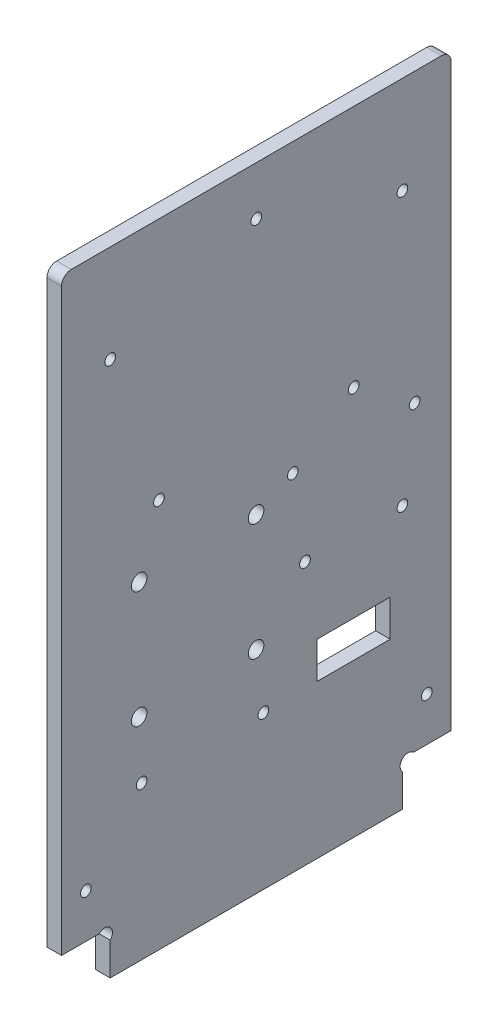
ISO-10303-21;
HEADER;
FILE_DESCRIPTION(('STEP AP214'),'2;1');
FILE_NAME('part.step','',(''),(''),'','','');
FILE_SCHEMA(('AUTOMOTIVE_DESIGN { 1 0 10303 214 1 1 1 1 }'));
ENDSEC;
DATA;
#1=APPLICATION_CONTEXT('core data for automotive mechanical design processes');
#2=APPLICATION_PROTOCOL_DEFINITION('international standard','automotive_design',2000,#1);
#3=PRODUCT_CONTEXT('',#1,'mechanical');
#4=PRODUCT('Part','Part','',(#3));
#5=PRODUCT_RELATED_PRODUCT_CATEGORY('part','',(#4));
#6=PRODUCT_DEFINITION_FORMATION('','',#4);
#7=PRODUCT_DEFINITION_CONTEXT('part definition',#1,'design');
#8=PRODUCT_DEFINITION('design','',#6,#7);
#9=PRODUCT_DEFINITION_SHAPE('','',#8);
#10=(LENGTH_UNIT() NAMED_UNIT(*) SI_UNIT(.MILLI.,.METRE.));
#11=(NAMED_UNIT(*) PLANE_ANGLE_UNIT() SI_UNIT($,.RADIAN.));
#12=(NAMED_UNIT(*) SI_UNIT($,.STERADIAN.) SOLID_ANGLE_UNIT());
#13=UNCERTAINTY_MEASURE_WITH_UNIT(LENGTH_MEASURE(1.E-05),#10,'distance_accuracy_value','');
#14=(GEOMETRIC_REPRESENTATION_CONTEXT(3) GLOBAL_UNCERTAINTY_ASSIGNED_CONTEXT((#13)) GLOBAL_UNIT_ASSIGNED_CONTEXT((#10,
#11,#12)) REPRESENTATION_CONTEXT('',''));
#15=CARTESIAN_POINT('',(0.,0.,0.));
#16=DIRECTION('',(0.,0.,1.));
#17=DIRECTION('',(1.,0.,0.));
#18=AXIS2_PLACEMENT_3D('',#15,#16,#17);
#19=CARTESIAN_POINT('',(3.,7.86862915010153,-8.86862915010152));
#20=DIRECTION('',(-1.,0.,0.));
#21=DIRECTION('',(0.,0.,1.));
#22=AXIS2_PLACEMENT_3D('',#19,#20,#21);
#23=CYLINDRICAL_SURFACE('',#22,1.6);
#24=CARTESIAN_POINT('',(0.,7.86862915010153,-8.86862915010152));
#25=DIRECTION('',(-1.,0.,0.));
#26=DIRECTION('',(0.,0.,-1.));
#27=AXIS2_PLACEMENT_3D('',#24,#25,#26);
#28=CIRCLE('',#27,1.6);
#29=CARTESIAN_POINT('',(0.,9.,-7.73725830020304));
#30=VERTEX_POINT('',#29);
#31=CARTESIAN_POINT('',(0.,6.73725830020305,-10.));
#32=VERTEX_POINT('',#31);
#33=EDGE_CURVE('E260',#30,#32,#28,.T.);
#34=ORIENTED_EDGE('',*,*,#33,.T.);
#35=DIRECTION('',(-1.,0.,0.));
#36=VECTOR('',#35,1.);
#37=CARTESIAN_POINT('',(3.,6.73725830020305,-10.));
#38=LINE('',#37,#36);
#39=CARTESIAN_POINT('',(3.,6.73725830020305,-10.));
#40=VERTEX_POINT('',#39);
#41=EDGE_CURVE('E326',#40,#32,#38,.T.);
#42=ORIENTED_EDGE('',*,*,#41,.F.);
#43=CARTESIAN_POINT('',(3.,7.86862915010153,-8.86862915010152));
#44=DIRECTION('',(-1.,0.,0.));
#45=DIRECTION('',(0.,0.,-1.));
#46=AXIS2_PLACEMENT_3D('',#43,#44,#45);
#47=CIRCLE('',#46,1.6);
#48=CARTESIAN_POINT('',(3.,9.,-7.73725830020304));
#49=VERTEX_POINT('',#48);
#50=EDGE_CURVE('E263',#49,#40,#47,.T.);
#51=ORIENTED_EDGE('',*,*,#50,.F.);
#52=DIRECTION('',(-1.,0.,0.));
#53=VECTOR('',#52,1.);
#54=CARTESIAN_POINT('',(3.,9.,-7.73725830020304));
#55=LINE('',#54,#53);
#56=EDGE_CURVE('E285',#49,#30,#55,.T.);
#57=ORIENTED_EDGE('',*,*,#56,.T.);
#58=EDGE_LOOP('',(#34,#42,#51,#57));
#59=FACE_BOUND('',#58,.T.);
#60=ADVANCED_FACE('F33',(#59),#23,.F.);
#61=CARTESIAN_POINT('',(3.,6.73725830020305,-10.));
#62=DIRECTION('',(0.,0.,-1.));
#63=DIRECTION('',(-1.,0.,0.));
#64=AXIS2_PLACEMENT_3D('',#61,#62,#63);
#65=PLANE('',#64);
#66=DIRECTION('',(0.,-1.,0.));
#67=VECTOR('',#66,1.);
#68=CARTESIAN_POINT('',(0.,6.73725830020305,-10.));
#69=LINE('',#68,#67);
#70=CARTESIAN_POINT('',(0.,0.,-10.));
#71=VERTEX_POINT('',#70);
#72=EDGE_CURVE('E288',#32,#71,#69,.T.);
#73=ORIENTED_EDGE('',*,*,#72,.T.);
#74=DIRECTION('',(-1.,0.,0.));
#75=VECTOR('',#74,1.);
#76=CARTESIAN_POINT('',(3.,0.,-10.));
#77=LINE('',#76,#75);
#78=CARTESIAN_POINT('',(3.,0.,-10.));
#79=VERTEX_POINT('',#78);
#80=EDGE_CURVE('E323',#79,#71,#77,.T.);
#81=ORIENTED_EDGE('',*,*,#80,.F.);
#82=DIRECTION('',(0.,-1.,0.));
#83=VECTOR('',#82,1.);
#84=CARTESIAN_POINT('',(3.,6.73725830020305,-10.));
#85=LINE('',#84,#83);
#86=EDGE_CURVE('E266',#40,#79,#85,.T.);
#87=ORIENTED_EDGE('',*,*,#86,.F.);
#88=ORIENTED_EDGE('',*,*,#41,.T.);
#89=EDGE_LOOP('',(#73,#81,#87,#88));
#90=FACE_BOUND('',#89,.T.);
#91=ADVANCED_FACE('F377',(#90),#65,.F.);
#92=CARTESIAN_POINT('',(3.,0.,-10.));
#93=DIRECTION('',(0.,1.,0.));
#94=DIRECTION('',(0.,0.,1.));
#95=AXIS2_PLACEMENT_3D('',#92,#93,#94);
#96=PLANE('',#95);
#97=DIRECTION('',(0.,0.,-1.));
#98=VECTOR('',#97,1.);
#99=CARTESIAN_POINT('',(0.,0.,-10.));
#100=LINE('',#99,#98);
#101=CARTESIAN_POINT('',(0.,0.,-70.));
#102=VERTEX_POINT('',#101);
#103=EDGE_CURVE('E290',#71,#102,#100,.T.);
#104=ORIENTED_EDGE('',*,*,#103,.T.);
#105=DIRECTION('',(-1.,0.,0.));
#106=VECTOR('',#105,1.);
#107=CARTESIAN_POINT('',(3.,0.,-70.));
#108=LINE('',#107,#106);
#109=CARTESIAN_POINT('',(3.,0.,-70.));
#110=VERTEX_POINT('',#109);
#111=EDGE_CURVE('E320',#110,#102,#108,.T.);
#112=ORIENTED_EDGE('',*,*,#111,.F.);
#113=DIRECTION('',(0.,0.,-1.));
#114=VECTOR('',#113,1.);
#115=CARTESIAN_POINT('',(3.,0.,-10.));
#116=LINE('',#115,#114);
#117=EDGE_CURVE('E269',#79,#110,#116,.T.);
#118=ORIENTED_EDGE('',*,*,#117,.F.);
#119=ORIENTED_EDGE('',*,*,#80,.T.);
#120=EDGE_LOOP('',(#104,#112,#118,#119));
#121=FACE_BOUND('',#120,.T.);
#122=ADVANCED_FACE('F371',(#121),#96,.F.);
#123=CARTESIAN_POINT('',(3.,6.73725830020307,-70.));
#124=DIRECTION('',(0.,0.,1.));
#125=DIRECTION('',(0.,-1.,0.));
#126=AXIS2_PLACEMENT_3D('',#123,#124,#125);
#127=PLANE('',#126);
#128=DIRECTION('',(0.,1.,0.));
#129=VECTOR('',#128,1.);
#130=CARTESIAN_POINT('',(0.,6.73725830020307,-70.));
#131=LINE('',#130,#129);
#132=CARTESIAN_POINT('',(0.,6.73725830020307,-70.));
#133=VERTEX_POINT('',#132);
#134=EDGE_CURVE('E292',#102,#133,#131,.T.);
#135=ORIENTED_EDGE('',*,*,#134,.T.);
#136=DIRECTION('',(-1.,0.,0.));
#137=VECTOR('',#136,1.);
#138=CARTESIAN_POINT('',(3.,6.73725830020307,-70.));
#139=LINE('',#138,#137);
#140=CARTESIAN_POINT('',(3.,6.73725830020307,-70.));
#141=VERTEX_POINT('',#140);
#142=EDGE_CURVE('E317',#141,#133,#139,.T.);
#143=ORIENTED_EDGE('',*,*,#142,.F.);
#144=DIRECTION('',(0.,1.,0.));
#145=VECTOR('',#144,1.);
#146=CARTESIAN_POINT('',(3.,6.73725830020307,-70.));
#147=LINE('',#146,#145);
#148=EDGE_CURVE('E271',#110,#141,#147,.T.);
#149=ORIENTED_EDGE('',*,*,#148,.F.);
#150=ORIENTED_EDGE('',*,*,#111,.T.);
#151=EDGE_LOOP('',(#135,#143,#149,#150));
#152=FACE_BOUND('',#151,.T.);
#153=ADVANCED_FACE('F367',(#152),#127,.F.);
#154=CARTESIAN_POINT('',(3.,7.86862915010154,-71.1313708498985));
#155=DIRECTION('',(-1.,0.,0.));
#156=DIRECTION('',(0.,0.,1.));
#157=AXIS2_PLACEMENT_3D('',#154,#155,#156);
#158=CYLINDRICAL_SURFACE('',#157,1.6);
#159=CARTESIAN_POINT('',(0.,7.86862915010154,-71.1313708498985));
#160=DIRECTION('',(-1.,0.,0.));
#161=DIRECTION('',(0.,0.,1.));
#162=AXIS2_PLACEMENT_3D('',#159,#160,#161);
#163=CIRCLE('',#162,1.6);
#164=CARTESIAN_POINT('',(0.,8.99999999999999,-72.262741699797));
#165=VERTEX_POINT('',#164);
#166=EDGE_CURVE('E294',#133,#165,#163,.T.);
#167=ORIENTED_EDGE('',*,*,#166,.T.);
#168=DIRECTION('',(-1.,0.,0.));
#169=VECTOR('',#168,1.);
#170=CARTESIAN_POINT('',(3.,8.99999999999999,-72.262741699797));
#171=LINE('',#170,#169);
#172=CARTESIAN_POINT('',(3.,8.99999999999999,-72.262741699797));
#173=VERTEX_POINT('',#172);
#174=EDGE_CURVE('E314',#173,#165,#171,.T.);
#175=ORIENTED_EDGE('',*,*,#174,.F.);
#176=CARTESIAN_POINT('',(3.,7.86862915010154,-71.1313708498985));
#177=DIRECTION('',(-1.,0.,0.));
#178=DIRECTION('',(0.,0.,1.));
#179=AXIS2_PLACEMENT_3D('',#176,#177,#178);
#180=CIRCLE('',#179,1.6);
#181=EDGE_CURVE('E273',#141,#173,#180,.T.);
#182=ORIENTED_EDGE('',*,*,#181,.F.);
#183=ORIENTED_EDGE('',*,*,#142,.T.);
#184=EDGE_LOOP('',(#167,#175,#182,#183));
#185=FACE_BOUND('',#184,.T.);
#186=ADVANCED_FACE('F362',(#185),#158,.F.);
#187=CARTESIAN_POINT('',(3.,8.99999999999999,-72.262741699797));
#188=DIRECTION('',(0.,1.,0.));
#189=DIRECTION('',(0.,0.,1.));
#190=AXIS2_PLACEMENT_3D('',#187,#188,#189);
#191=PLANE('',#190);
#192=DIRECTION('',(0.,0.,-1.));
#193=VECTOR('',#192,1.);
#194=CARTESIAN_POINT('',(0.,8.99999999999999,-72.262741699797));
#195=LINE('',#194,#193);
#196=CARTESIAN_POINT('',(0.,8.99999999999999,-80.));
#197=VERTEX_POINT('',#196);
#198=EDGE_CURVE('E296',#165,#197,#195,.T.);
#199=ORIENTED_EDGE('',*,*,#198,.T.);
#200=DIRECTION('',(-1.,0.,0.));
#201=VECTOR('',#200,1.);
#202=CARTESIAN_POINT('',(3.,8.99999999999999,-80.));
#203=LINE('',#202,#201);
#204=CARTESIAN_POINT('',(3.,8.99999999999999,-80.));
#205=VERTEX_POINT('',#204);
#206=EDGE_CURVE('E311',#205,#197,#203,.T.);
#207=ORIENTED_EDGE('',*,*,#206,.F.);
#208=DIRECTION('',(0.,0.,-1.));
#209=VECTOR('',#208,1.);
#210=CARTESIAN_POINT('',(3.,8.99999999999999,-72.262741699797));
#211=LINE('',#210,#209);
#212=EDGE_CURVE('E275',#173,#205,#211,.T.);
#213=ORIENTED_EDGE('',*,*,#212,.F.);
#214=ORIENTED_EDGE('',*,*,#174,.T.);
#215=EDGE_LOOP('',(#199,#207,#213,#214));
#216=FACE_BOUND('',#215,.T.);
#217=ADVANCED_FACE('F356',(#216),#191,.F.);
#218=CARTESIAN_POINT('',(3.,130.,-80.));
#219=DIRECTION('',(0.,0.,1.));
#220=DIRECTION('',(0.,-1.,0.));
#221=AXIS2_PLACEMENT_3D('',#218,#219,#220);
#222=PLANE('',#221);
#223=DIRECTION('',(0.,1.,0.));
#224=VECTOR('',#223,1.);
#225=CARTESIAN_POINT('',(0.,130.,-80.));
#226=LINE('',#225,#224);
#227=CARTESIAN_POINT('',(0.,128.,-80.));
#228=VERTEX_POINT('',#227);
#229=EDGE_CURVE('E298',#197,#228,#226,.T.);
#230=ORIENTED_EDGE('',*,*,#229,.T.);
#231=DIRECTION('',(-1.,0.,0.));
#232=VECTOR('',#231,1.);
#233=CARTESIAN_POINT('',(3.,128.,-80.));
#234=LINE('',#233,#232);
#235=CARTESIAN_POINT('',(3.,128.,-80.));
#236=VERTEX_POINT('',#235);
#237=EDGE_CURVE('E56',#228,#236,#234,.F.);
#238=ORIENTED_EDGE('',*,*,#237,.T.);
#239=DIRECTION('',(0.,1.,0.));
#240=VECTOR('',#239,1.);
#241=CARTESIAN_POINT('',(3.,130.,-80.));
#242=LINE('',#241,#240);
#243=EDGE_CURVE('E277',#205,#236,#242,.T.);
#244=ORIENTED_EDGE('',*,*,#243,.F.);
#245=ORIENTED_EDGE('',*,*,#206,.T.);
#246=EDGE_LOOP('',(#230,#238,#244,#245));
#247=FACE_BOUND('',#246,.T.);
#248=ADVANCED_FACE('F352',(#247),#222,.F.);
#249=CARTESIAN_POINT('',(3.,130.,0.));
#250=DIRECTION('',(0.,-1.,0.));
#251=DIRECTION('',(0.,0.,-1.));
#252=AXIS2_PLACEMENT_3D('',#249,#250,#251);
#253=PLANE('',#252);
#254=DIRECTION('',(0.,0.,1.));
#255=VECTOR('',#254,1.);
#256=CARTESIAN_POINT('',(3.,130.,0.));
#257=LINE('',#256,#255);
#258=CARTESIAN_POINT('',(3.,130.,-78.));
#259=VERTEX_POINT('',#258);
#260=CARTESIAN_POINT('',(3.,130.,-2.));
#261=VERTEX_POINT('',#260);
#262=EDGE_CURVE('E279',#259,#261,#257,.T.);
#263=ORIENTED_EDGE('',*,*,#262,.F.);
#264=DIRECTION('',(-1.,0.,0.));
#265=VECTOR('',#264,1.);
#266=CARTESIAN_POINT('',(3.,130.,-78.));
#267=LINE('',#266,#265);
#268=CARTESIAN_POINT('',(0.,130.,-78.));
#269=VERTEX_POINT('',#268);
#270=EDGE_CURVE('E331',#259,#269,#267,.T.);
#271=ORIENTED_EDGE('',*,*,#270,.T.);
#272=DIRECTION('',(0.,0.,1.));
#273=VECTOR('',#272,1.);
#274=CARTESIAN_POINT('',(0.,130.,0.));
#275=LINE('',#274,#273);
#276=CARTESIAN_POINT('',(0.,130.,-2.));
#277=VERTEX_POINT('',#276);
#278=EDGE_CURVE('E300',#269,#277,#275,.T.);
#279=ORIENTED_EDGE('',*,*,#278,.T.);
#280=DIRECTION('',(-1.,0.,0.));
#281=VECTOR('',#280,1.);
#282=CARTESIAN_POINT('',(3.,130.,-2.));
#283=LINE('',#282,#281);
#284=EDGE_CURVE('E329',#277,#261,#283,.F.);
#285=ORIENTED_EDGE('',*,*,#284,.T.);
#286=EDGE_LOOP('',(#263,#271,#279,#285));
#287=FACE_BOUND('',#286,.T.);
#288=ADVANCED_FACE('F344',(#287),#253,.F.);
#289=CARTESIAN_POINT('',(3.,9.,0.));
#290=DIRECTION('',(0.,0.,-1.));
#291=DIRECTION('',(-1.,0.,0.));
#292=AXIS2_PLACEMENT_3D('',#289,#290,#291);
#293=PLANE('',#292);
#294=DIRECTION('',(0.,-1.,0.));
#295=VECTOR('',#294,1.);
#296=CARTESIAN_POINT('',(3.,9.,0.));
#297=LINE('',#296,#295);
#298=CARTESIAN_POINT('',(3.,128.,0.));
#299=VERTEX_POINT('',#298);
#300=CARTESIAN_POINT('',(3.,9.,0.));
#301=VERTEX_POINT('',#300);
#302=EDGE_CURVE('E281',#299,#301,#297,.T.);
#303=ORIENTED_EDGE('',*,*,#302,.F.);
#304=DIRECTION('',(-1.,0.,0.));
#305=VECTOR('',#304,1.);
#306=CARTESIAN_POINT('',(3.,128.,0.));
#307=LINE('',#306,#305);
#308=CARTESIAN_POINT('',(0.,128.,0.));
#309=VERTEX_POINT('',#308);
#310=EDGE_CURVE('E11',#299,#309,#307,.T.);
#311=ORIENTED_EDGE('',*,*,#310,.T.);
#312=DIRECTION('',(0.,-1.,0.));
#313=VECTOR('',#312,1.);
#314=CARTESIAN_POINT('',(0.,9.,0.));
#315=LINE('',#314,#313);
#316=CARTESIAN_POINT('',(0.,9.,0.));
#317=VERTEX_POINT('',#316);
#318=EDGE_CURVE('E303',#309,#317,#315,.T.);
#319=ORIENTED_EDGE('',*,*,#318,.T.);
#320=DIRECTION('',(-1.,0.,0.));
#321=VECTOR('',#320,1.);
#322=CARTESIAN_POINT('',(3.,9.,0.));
#323=LINE('',#322,#321);
#324=EDGE_CURVE('E308',#301,#317,#323,.T.);
#325=ORIENTED_EDGE('',*,*,#324,.F.);
#326=EDGE_LOOP('',(#303,#311,#319,#325));
#327=FACE_BOUND('',#326,.T.);
#328=ADVANCED_FACE('F387',(#327),#293,.F.);
#329=CARTESIAN_POINT('',(3.,9.,-7.73725830020304));
#330=DIRECTION('',(0.,1.,0.));
#331=DIRECTION('',(0.,0.,1.));
#332=AXIS2_PLACEMENT_3D('',#329,#330,#331);
#333=PLANE('',#332);
#334=DIRECTION('',(0.,0.,-1.));
#335=VECTOR('',#334,1.);
#336=CARTESIAN_POINT('',(0.,9.,-7.73725830020304));
#337=LINE('',#336,#335);
#338=EDGE_CURVE('E267',#317,#30,#337,.T.);
#339=ORIENTED_EDGE('',*,*,#338,.T.);
#340=ORIENTED_EDGE('',*,*,#56,.F.);
#341=DIRECTION('',(0.,0.,-1.));
#342=VECTOR('',#341,1.);
#343=CARTESIAN_POINT('',(3.,9.,-7.73725830020304));
#344=LINE('',#343,#342);
#345=EDGE_CURVE('E283',#301,#49,#344,.T.);
#346=ORIENTED_EDGE('',*,*,#345,.F.);
#347=ORIENTED_EDGE('',*,*,#324,.T.);
#348=EDGE_LOOP('',(#339,#340,#346,#347));
#349=FACE_BOUND('',#348,.T.);
#350=ADVANCED_FACE('F383',(#349),#333,.F.);
#351=CARTESIAN_POINT('',(3.,7.86862915010153,-8.86862915010152));
#352=DIRECTION('',(1.,0.,0.));
#353=DIRECTION('',(0.,0.,-1.));
#354=AXIS2_PLACEMENT_3D('',#351,#352,#353);
#355=PLANE('',#354);
#356=CARTESIAN_POINT('',(3.,31.45,-16.45));
#357=DIRECTION('',(1.,0.,0.));
#358=DIRECTION('',(0.,0.,-1.));
#359=AXIS2_PLACEMENT_3D('',#356,#357,#358);
#360=CIRCLE('',#359,1.1);
#361=CARTESIAN_POINT('',(3.,31.45,-17.55));
#362=VERTEX_POINT('',#361);
#363=EDGE_CURVE('E510',#362,#362,#360,.T.);
#364=ORIENTED_EDGE('',*,*,#363,.F.);
#365=EDGE_LOOP('',(#364));
#366=FACE_BOUND('',#365,.T.);
#367=CARTESIAN_POINT('',(3.,31.45,-41.45));
#368=DIRECTION('',(1.,0.,0.));
#369=DIRECTION('',(0.,0.,-1.));
#370=AXIS2_PLACEMENT_3D('',#367,#368,#369);
#371=CIRCLE('',#370,1.1);
#372=CARTESIAN_POINT('',(3.,31.45,-42.55));
#373=VERTEX_POINT('',#372);
#374=EDGE_CURVE('E515',#373,#373,#371,.T.);
#375=ORIENTED_EDGE('',*,*,#374,.F.);
#376=EDGE_LOOP('',(#375));
#377=FACE_BOUND('',#376,.T.);
#378=CARTESIAN_POINT('',(3.,71.,-47.5));
#379=DIRECTION('',(1.,0.,0.));
#380=DIRECTION('',(0.,0.,-1.));
#381=AXIS2_PLACEMENT_3D('',#378,#379,#380);
#382=CIRCLE('',#381,1.1);
#383=CARTESIAN_POINT('',(3.,71.,-48.6));
#384=VERTEX_POINT('',#383);
#385=EDGE_CURVE('E523',#384,#384,#382,.T.);
#386=ORIENTED_EDGE('',*,*,#385,.F.);
#387=EDGE_LOOP('',(#386));
#388=FACE_BOUND('',#387,.T.);
#389=CARTESIAN_POINT('',(3.,71.,-72.5));
#390=DIRECTION('',(1.,0.,0.));
#391=DIRECTION('',(0.,0.,-1.));
#392=AXIS2_PLACEMENT_3D('',#389,#390,#391);
#393=CIRCLE('',#392,1.10000000000001);
#394=CARTESIAN_POINT('',(3.,71.,-73.6));
#395=VERTEX_POINT('',#394);
#396=EDGE_CURVE('E529',#395,#395,#393,.T.);
#397=ORIENTED_EDGE('',*,*,#396,.F.);
#398=EDGE_LOOP('',(#397));
#399=FACE_BOUND('',#398,.T.);
#400=CARTESIAN_POINT('',(3.,18.,-75.));
#401=DIRECTION('',(1.,0.,0.));
#402=DIRECTION('',(0.,0.,-1.));
#403=AXIS2_PLACEMENT_3D('',#400,#401,#402);
#404=CIRCLE('',#403,1.10000000000001);
#405=CARTESIAN_POINT('',(3.,18.,-76.1));
#406=VERTEX_POINT('',#405);
#407=EDGE_CURVE('E534',#406,#406,#404,.T.);
#408=ORIENTED_EDGE('',*,*,#407,.F.);
#409=EDGE_LOOP('',(#408));
#410=FACE_BOUND('',#409,.T.);
#411=CARTESIAN_POINT('',(3.,18.,-5.));
#412=DIRECTION('',(1.,0.,0.));
#413=DIRECTION('',(0.,0.,-1.));
#414=AXIS2_PLACEMENT_3D('',#411,#412,#413);
#415=CIRCLE('',#414,1.1);
#416=CARTESIAN_POINT('',(3.,18.,-6.1));
#417=VERTEX_POINT('',#416);
#418=EDGE_CURVE('E180',#417,#417,#415,.T.);
#419=ORIENTED_EDGE('',*,*,#418,.F.);
#420=EDGE_LOOP('',(#419));
#421=FACE_BOUND('',#420,.T.);
#422=DIRECTION('',(0.,-1.,0.));
#423=VECTOR('',#422,1.);
#424=CARTESIAN_POINT('',(3.,39.,-67.5));
#425=LINE('',#424,#423);
#426=CARTESIAN_POINT('',(3.,39.,-67.5));
#427=VERTEX_POINT('',#426);
#428=CARTESIAN_POINT('',(3.,31.5,-67.5));
#429=VERTEX_POINT('',#428);
#430=EDGE_CURVE('E153',#427,#429,#425,.T.);
#431=ORIENTED_EDGE('',*,*,#430,.T.);
#432=DIRECTION('',(0.,0.,1.));
#433=VECTOR('',#432,1.);
#434=CARTESIAN_POINT('',(3.,31.5,-67.5));
#435=LINE('',#434,#433);
#436=CARTESIAN_POINT('',(3.,31.5,-52.5));
#437=VERTEX_POINT('',#436);
#438=EDGE_CURVE('E165',#429,#437,#435,.T.);
#439=ORIENTED_EDGE('',*,*,#438,.T.);
#440=DIRECTION('',(0.,1.,0.));
#441=VECTOR('',#440,1.);
#442=CARTESIAN_POINT('',(3.,39.,-52.5));
#443=LINE('',#442,#441);
#444=CARTESIAN_POINT('',(3.,39.,-52.5));
#445=VERTEX_POINT('',#444);
#446=EDGE_CURVE('E169',#437,#445,#443,.T.);
#447=ORIENTED_EDGE('',*,*,#446,.T.);
#448=DIRECTION('',(0.,0.,-1.));
#449=VECTOR('',#448,1.);
#450=CARTESIAN_POINT('',(3.,39.,-67.5));
#451=LINE('',#450,#449);
#452=EDGE_CURVE('E161',#445,#427,#451,.T.);
#453=ORIENTED_EDGE('',*,*,#452,.T.);
#454=EDGE_LOOP('',(#431,#439,#447,#453));
#455=FACE_BOUND('',#454,.T.);
#456=CARTESIAN_POINT('',(3.,67.45,-39.95));
#457=DIRECTION('',(1.,0.,0.));
#458=DIRECTION('',(0.,0.,-1.));
#459=AXIS2_PLACEMENT_3D('',#456,#457,#458);
#460=CIRCLE('',#459,1.6);
#461=CARTESIAN_POINT('',(3.,67.45,-41.55));
#462=VERTEX_POINT('',#461);
#463=EDGE_CURVE('E193',#462,#462,#460,.T.);
#464=ORIENTED_EDGE('',*,*,#463,.F.);
#465=EDGE_LOOP('',(#464));
#466=FACE_BOUND('',#465,.T.);
#467=CARTESIAN_POINT('',(3.,43.45,-39.95));
#468=DIRECTION('',(1.,0.,0.));
#469=DIRECTION('',(0.,0.,-1.));
#470=AXIS2_PLACEMENT_3D('',#467,#468,#469);
#471=CIRCLE('',#470,1.6);
#472=CARTESIAN_POINT('',(3.,43.45,-41.55));
#473=VERTEX_POINT('',#472);
#474=EDGE_CURVE('E200',#473,#473,#471,.T.);
#475=ORIENTED_EDGE('',*,*,#474,.F.);
#476=EDGE_LOOP('',(#475));
#477=FACE_BOUND('',#476,.T.);
#478=CARTESIAN_POINT('',(3.,43.45,-15.95));
#479=DIRECTION('',(1.,0.,0.));
#480=DIRECTION('',(0.,0.,-1.));
#481=AXIS2_PLACEMENT_3D('',#478,#479,#480);
#482=CIRCLE('',#481,1.6);
#483=CARTESIAN_POINT('',(3.,43.45,-17.55));
#484=VERTEX_POINT('',#483);
#485=EDGE_CURVE('E206',#484,#484,#482,.T.);
#486=ORIENTED_EDGE('',*,*,#485,.F.);
#487=EDGE_LOOP('',(#486));
#488=FACE_BOUND('',#487,.T.);
#489=CARTESIAN_POINT('',(3.,67.45,-15.95));
#490=DIRECTION('',(1.,0.,0.));
#491=DIRECTION('',(0.,0.,-1.));
#492=AXIS2_PLACEMENT_3D('',#489,#490,#491);
#493=CIRCLE('',#492,1.6);
#494=CARTESIAN_POINT('',(3.,67.45,-17.55));
#495=VERTEX_POINT('',#494);
#496=EDGE_CURVE('E212',#495,#495,#493,.T.);
#497=ORIENTED_EDGE('',*,*,#496,.F.);
#498=EDGE_LOOP('',(#497));
#499=FACE_BOUND('',#498,.T.);
#500=CARTESIAN_POINT('',(3.,120.,-40.));
#501=DIRECTION('',(1.,0.,0.));
#502=DIRECTION('',(0.,0.,-1.));
#503=AXIS2_PLACEMENT_3D('',#500,#501,#502);
#504=CIRCLE('',#503,1.1);
#505=CARTESIAN_POINT('',(3.,120.,-41.1));
#506=VERTEX_POINT('',#505);
#507=EDGE_CURVE('E218',#506,#506,#504,.T.);
#508=ORIENTED_EDGE('',*,*,#507,.F.);
#509=EDGE_LOOP('',(#508));
#510=FACE_BOUND('',#509,.T.);
#511=CARTESIAN_POINT('',(3.,80.,-20.));
#512=DIRECTION('',(1.,0.,0.));
#513=DIRECTION('',(0.,0.,1.));
#514=AXIS2_PLACEMENT_3D('',#511,#512,#513);
#515=CIRCLE('',#514,1.1);
#516=CARTESIAN_POINT('',(3.,80.,-18.9));
#517=VERTEX_POINT('',#516);
#518=EDGE_CURVE('E224',#517,#517,#515,.T.);
#519=ORIENTED_EDGE('',*,*,#518,.F.);
#520=EDGE_LOOP('',(#519));
#521=FACE_BOUND('',#520,.T.);
#522=CARTESIAN_POINT('',(3.,54.,-70.));
#523=DIRECTION('',(1.,0.,0.));
#524=DIRECTION('',(0.,0.,-1.));
#525=AXIS2_PLACEMENT_3D('',#522,#523,#524);
#526=CIRCLE('',#525,1.10000000000001);
#527=CARTESIAN_POINT('',(3.,54.,-71.1));
#528=VERTEX_POINT('',#527);
#529=EDGE_CURVE('E230',#528,#528,#526,.T.);
#530=ORIENTED_EDGE('',*,*,#529,.F.);
#531=EDGE_LOOP('',(#530));
#532=FACE_BOUND('',#531,.T.);
#533=CARTESIAN_POINT('',(3.,54.,-50.));
#534=DIRECTION('',(1.,0.,0.));
#535=DIRECTION('',(0.,0.,-1.));
#536=AXIS2_PLACEMENT_3D('',#533,#534,#535);
#537=CIRCLE('',#536,1.1);
#538=CARTESIAN_POINT('',(3.,54.,-51.1));
#539=VERTEX_POINT('',#538);
#540=EDGE_CURVE('E236',#539,#539,#537,.T.);
#541=ORIENTED_EDGE('',*,*,#540,.F.);
#542=EDGE_LOOP('',(#541));
#543=FACE_BOUND('',#542,.T.);
#544=CARTESIAN_POINT('',(3.,110.,-70.));
#545=DIRECTION('',(1.,0.,0.));
#546=DIRECTION('',(0.,0.,-1.));
#547=AXIS2_PLACEMENT_3D('',#544,#545,#546);
#548=CIRCLE('',#547,1.10000000000001);
#549=CARTESIAN_POINT('',(3.,110.,-71.1));
#550=VERTEX_POINT('',#549);
#551=EDGE_CURVE('E242',#550,#550,#548,.T.);
#552=ORIENTED_EDGE('',*,*,#551,.F.);
#553=EDGE_LOOP('',(#552));
#554=FACE_BOUND('',#553,.T.);
#555=CARTESIAN_POINT('',(3.,80.,-60.));
#556=DIRECTION('',(1.,0.,0.));
#557=DIRECTION('',(0.,0.,-1.));
#558=AXIS2_PLACEMENT_3D('',#555,#556,#557);
#559=CIRCLE('',#558,1.1);
#560=CARTESIAN_POINT('',(3.,80.,-61.1));
#561=VERTEX_POINT('',#560);
#562=EDGE_CURVE('E248',#561,#561,#559,.T.);
#563=ORIENTED_EDGE('',*,*,#562,.F.);
#564=EDGE_LOOP('',(#563));
#565=FACE_BOUND('',#564,.T.);
#566=CARTESIAN_POINT('',(3.,110.,-10.));
#567=DIRECTION('',(1.,0.,0.));
#568=DIRECTION('',(0.,0.,-1.));
#569=AXIS2_PLACEMENT_3D('',#566,#567,#568);
#570=CIRCLE('',#569,1.1);
#571=CARTESIAN_POINT('',(3.,110.,-11.1));
#572=VERTEX_POINT('',#571);
#573=EDGE_CURVE('E254',#572,#572,#570,.T.);
#574=ORIENTED_EDGE('',*,*,#573,.F.);
#575=EDGE_LOOP('',(#574));
#576=FACE_BOUND('',#575,.T.);
#577=ORIENTED_EDGE('',*,*,#243,.T.);
#578=CARTESIAN_POINT('',(3.,128.,-78.));
#579=DIRECTION('',(1.,0.,0.));
#580=DIRECTION('',(0.,0.,-1.));
#581=AXIS2_PLACEMENT_3D('',#578,#579,#580);
#582=CIRCLE('',#581,2.);
#583=EDGE_CURVE('E41',#236,#259,#582,.T.);
#584=ORIENTED_EDGE('',*,*,#583,.T.);
#585=ORIENTED_EDGE('',*,*,#262,.T.);
#586=CARTESIAN_POINT('',(3.,128.,-2.));
#587=DIRECTION('',(1.,0.,0.));
#588=DIRECTION('',(0.,0.,-1.));
#589=AXIS2_PLACEMENT_3D('',#586,#587,#588);
#590=CIRCLE('',#589,2.);
#591=EDGE_CURVE('E48',#261,#299,#590,.T.);
#592=ORIENTED_EDGE('',*,*,#591,.T.);
#593=ORIENTED_EDGE('',*,*,#302,.T.);
#594=ORIENTED_EDGE('',*,*,#345,.T.);
#595=ORIENTED_EDGE('',*,*,#50,.T.);
#596=ORIENTED_EDGE('',*,*,#86,.T.);
#597=ORIENTED_EDGE('',*,*,#117,.T.);
#598=ORIENTED_EDGE('',*,*,#148,.T.);
#599=ORIENTED_EDGE('',*,*,#181,.T.);
#600=ORIENTED_EDGE('',*,*,#212,.T.);
#601=EDGE_LOOP('',(#577,#584,#585,#592,#593,#594,#595,#596,#597,#598,#599,#600));
#602=FACE_BOUND('',#601,.T.);
#603=ADVANCED_FACE('F171',(#366,#377,#388,#399,#410,#421,#455,#466,#477,#488,#499,#510,#521,
#532,#543,#554,#565,#576,#602),#355,.T.);
#604=CARTESIAN_POINT('',(0.,7.86862915010153,-8.86862915010152));
#605=DIRECTION('',(1.,0.,0.));
#606=DIRECTION('',(0.,0.,-1.));
#607=AXIS2_PLACEMENT_3D('',#604,#605,#606);
#608=PLANE('',#607);
#609=CARTESIAN_POINT('',(0.,31.45,-16.45));
#610=DIRECTION('',(1.,0.,0.));
#611=DIRECTION('',(0.,0.,-1.));
#612=AXIS2_PLACEMENT_3D('',#609,#610,#611);
#613=CIRCLE('',#612,1.1);
#614=CARTESIAN_POINT('',(0.,31.45,-17.55));
#615=VERTEX_POINT('',#614);
#616=EDGE_CURVE('E507',#615,#615,#613,.T.);
#617=ORIENTED_EDGE('',*,*,#616,.T.);
#618=EDGE_LOOP('',(#617));
#619=FACE_BOUND('',#618,.T.);
#620=CARTESIAN_POINT('',(0.,31.45,-41.45));
#621=DIRECTION('',(1.,0.,0.));
#622=DIRECTION('',(0.,0.,-1.));
#623=AXIS2_PLACEMENT_3D('',#620,#621,#622);
#624=CIRCLE('',#623,1.1);
#625=CARTESIAN_POINT('',(0.,31.45,-42.55));
#626=VERTEX_POINT('',#625);
#627=EDGE_CURVE('E511',#626,#626,#624,.T.);
#628=ORIENTED_EDGE('',*,*,#627,.T.);
#629=EDGE_LOOP('',(#628));
#630=FACE_BOUND('',#629,.T.);
#631=CARTESIAN_POINT('',(0.,71.,-47.5));
#632=DIRECTION('',(1.,0.,0.));
#633=DIRECTION('',(0.,0.,-1.));
#634=AXIS2_PLACEMENT_3D('',#631,#632,#633);
#635=CIRCLE('',#634,1.1);
#636=CARTESIAN_POINT('',(0.,71.,-48.6));
#637=VERTEX_POINT('',#636);
#638=EDGE_CURVE('E520',#637,#637,#635,.T.);
#639=ORIENTED_EDGE('',*,*,#638,.T.);
#640=EDGE_LOOP('',(#639));
#641=FACE_BOUND('',#640,.T.);
#642=CARTESIAN_POINT('',(0.,71.,-72.5));
#643=DIRECTION('',(1.,0.,0.));
#644=DIRECTION('',(0.,0.,-1.));
#645=AXIS2_PLACEMENT_3D('',#642,#643,#644);
#646=CIRCLE('',#645,1.10000000000001);
#647=CARTESIAN_POINT('',(0.,71.,-73.6));
#648=VERTEX_POINT('',#647);
#649=EDGE_CURVE('E526',#648,#648,#646,.T.);
#650=ORIENTED_EDGE('',*,*,#649,.T.);
#651=EDGE_LOOP('',(#650));
#652=FACE_BOUND('',#651,.T.);
#653=CARTESIAN_POINT('',(0.,18.,-75.));
#654=DIRECTION('',(1.,0.,0.));
#655=DIRECTION('',(0.,0.,-1.));
#656=AXIS2_PLACEMENT_3D('',#653,#654,#655);
#657=CIRCLE('',#656,1.10000000000001);
#658=CARTESIAN_POINT('',(0.,18.,-76.1));
#659=VERTEX_POINT('',#658);
#660=EDGE_CURVE('E187',#659,#659,#657,.T.);
#661=ORIENTED_EDGE('',*,*,#660,.T.);
#662=EDGE_LOOP('',(#661));
#663=FACE_BOUND('',#662,.T.);
#664=CARTESIAN_POINT('',(0.,18.,-5.));
#665=DIRECTION('',(1.,0.,0.));
#666=DIRECTION('',(0.,0.,-1.));
#667=AXIS2_PLACEMENT_3D('',#664,#665,#666);
#668=CIRCLE('',#667,1.1);
#669=CARTESIAN_POINT('',(0.,18.,-6.1));
#670=VERTEX_POINT('',#669);
#671=EDGE_CURVE('E536',#670,#670,#668,.T.);
#672=ORIENTED_EDGE('',*,*,#671,.T.);
#673=EDGE_LOOP('',(#672));
#674=FACE_BOUND('',#673,.T.);
#675=DIRECTION('',(0.,0.,1.));
#676=VECTOR('',#675,1.);
#677=CARTESIAN_POINT('',(0.,31.5,-67.5));
#678=LINE('',#677,#676);
#679=CARTESIAN_POINT('',(0.,31.5,-67.5));
#680=VERTEX_POINT('',#679);
#681=CARTESIAN_POINT('',(0.,31.5,-52.5));
#682=VERTEX_POINT('',#681);
#683=EDGE_CURVE('E186',#680,#682,#678,.T.);
#684=ORIENTED_EDGE('',*,*,#683,.F.);
#685=DIRECTION('',(0.,-1.,0.));
#686=VECTOR('',#685,1.);
#687=CARTESIAN_POINT('',(0.,39.,-67.5));
#688=LINE('',#687,#686);
#689=CARTESIAN_POINT('',(0.,39.,-67.5));
#690=VERTEX_POINT('',#689);
#691=EDGE_CURVE('E156',#690,#680,#688,.T.);
#692=ORIENTED_EDGE('',*,*,#691,.F.);
#693=DIRECTION('',(0.,0.,-1.));
#694=VECTOR('',#693,1.);
#695=CARTESIAN_POINT('',(0.,39.,-67.5));
#696=LINE('',#695,#694);
#697=CARTESIAN_POINT('',(0.,39.,-52.5));
#698=VERTEX_POINT('',#697);
#699=EDGE_CURVE('E174',#698,#690,#696,.T.);
#700=ORIENTED_EDGE('',*,*,#699,.F.);
#701=DIRECTION('',(0.,1.,0.));
#702=VECTOR('',#701,1.);
#703=CARTESIAN_POINT('',(0.,39.,-52.5));
#704=LINE('',#703,#702);
#705=EDGE_CURVE('E177',#682,#698,#704,.T.);
#706=ORIENTED_EDGE('',*,*,#705,.F.);
#707=EDGE_LOOP('',(#684,#692,#700,#706));
#708=FACE_BOUND('',#707,.T.);
#709=CARTESIAN_POINT('',(0.,67.45,-39.95));
#710=DIRECTION('',(1.,0.,0.));
#711=DIRECTION('',(0.,0.,-1.));
#712=AXIS2_PLACEMENT_3D('',#709,#710,#711);
#713=CIRCLE('',#712,1.6);
#714=CARTESIAN_POINT('',(0.,67.45,-41.55));
#715=VERTEX_POINT('',#714);
#716=EDGE_CURVE('E197',#715,#715,#713,.T.);
#717=ORIENTED_EDGE('',*,*,#716,.T.);
#718=EDGE_LOOP('',(#717));
#719=FACE_BOUND('',#718,.T.);
#720=CARTESIAN_POINT('',(0.,43.45,-39.95));
#721=DIRECTION('',(1.,0.,0.));
#722=DIRECTION('',(0.,0.,-1.));
#723=AXIS2_PLACEMENT_3D('',#720,#721,#722);
#724=CIRCLE('',#723,1.6);
#725=CARTESIAN_POINT('',(0.,43.45,-41.55));
#726=VERTEX_POINT('',#725);
#727=EDGE_CURVE('E203',#726,#726,#724,.T.);
#728=ORIENTED_EDGE('',*,*,#727,.T.);
#729=EDGE_LOOP('',(#728));
#730=FACE_BOUND('',#729,.T.);
#731=CARTESIAN_POINT('',(0.,43.45,-15.95));
#732=DIRECTION('',(1.,0.,0.));
#733=DIRECTION('',(0.,0.,-1.));
#734=AXIS2_PLACEMENT_3D('',#731,#732,#733);
#735=CIRCLE('',#734,1.6);
#736=CARTESIAN_POINT('',(0.,43.45,-17.55));
#737=VERTEX_POINT('',#736);
#738=EDGE_CURVE('E209',#737,#737,#735,.T.);
#739=ORIENTED_EDGE('',*,*,#738,.T.);
#740=EDGE_LOOP('',(#739));
#741=FACE_BOUND('',#740,.T.);
#742=CARTESIAN_POINT('',(0.,67.45,-15.95));
#743=DIRECTION('',(1.,0.,0.));
#744=DIRECTION('',(0.,0.,-1.));
#745=AXIS2_PLACEMENT_3D('',#742,#743,#744);
#746=CIRCLE('',#745,1.6);
#747=CARTESIAN_POINT('',(0.,67.45,-17.55));
#748=VERTEX_POINT('',#747);
#749=EDGE_CURVE('E215',#748,#748,#746,.T.);
#750=ORIENTED_EDGE('',*,*,#749,.T.);
#751=EDGE_LOOP('',(#750));
#752=FACE_BOUND('',#751,.T.);
#753=CARTESIAN_POINT('',(0.,120.,-40.));
#754=DIRECTION('',(1.,0.,0.));
#755=DIRECTION('',(0.,0.,-1.));
#756=AXIS2_PLACEMENT_3D('',#753,#754,#755);
#757=CIRCLE('',#756,1.1);
#758=CARTESIAN_POINT('',(0.,120.,-41.1));
#759=VERTEX_POINT('',#758);
#760=EDGE_CURVE('E221',#759,#759,#757,.T.);
#761=ORIENTED_EDGE('',*,*,#760,.T.);
#762=EDGE_LOOP('',(#761));
#763=FACE_BOUND('',#762,.T.);
#764=CARTESIAN_POINT('',(0.,80.,-20.));
#765=DIRECTION('',(1.,0.,0.));
#766=DIRECTION('',(0.,0.,1.));
#767=AXIS2_PLACEMENT_3D('',#764,#765,#766);
#768=CIRCLE('',#767,1.1);
#769=CARTESIAN_POINT('',(0.,80.,-18.9));
#770=VERTEX_POINT('',#769);
#771=EDGE_CURVE('E227',#770,#770,#768,.T.);
#772=ORIENTED_EDGE('',*,*,#771,.T.);
#773=EDGE_LOOP('',(#772));
#774=FACE_BOUND('',#773,.T.);
#775=CARTESIAN_POINT('',(0.,54.,-70.));
#776=DIRECTION('',(1.,0.,0.));
#777=DIRECTION('',(0.,0.,-1.));
#778=AXIS2_PLACEMENT_3D('',#775,#776,#777);
#779=CIRCLE('',#778,1.10000000000001);
#780=CARTESIAN_POINT('',(0.,54.,-71.1));
#781=VERTEX_POINT('',#780);
#782=EDGE_CURVE('E233',#781,#781,#779,.T.);
#783=ORIENTED_EDGE('',*,*,#782,.T.);
#784=EDGE_LOOP('',(#783));
#785=FACE_BOUND('',#784,.T.);
#786=CARTESIAN_POINT('',(0.,54.,-50.));
#787=DIRECTION('',(1.,0.,0.));
#788=DIRECTION('',(0.,0.,-1.));
#789=AXIS2_PLACEMENT_3D('',#786,#787,#788);
#790=CIRCLE('',#789,1.1);
#791=CARTESIAN_POINT('',(0.,54.,-51.1));
#792=VERTEX_POINT('',#791);
#793=EDGE_CURVE('E239',#792,#792,#790,.T.);
#794=ORIENTED_EDGE('',*,*,#793,.T.);
#795=EDGE_LOOP('',(#794));
#796=FACE_BOUND('',#795,.T.);
#797=CARTESIAN_POINT('',(0.,110.,-70.));
#798=DIRECTION('',(1.,0.,0.));
#799=DIRECTION('',(0.,0.,-1.));
#800=AXIS2_PLACEMENT_3D('',#797,#798,#799);
#801=CIRCLE('',#800,1.10000000000001);
#802=CARTESIAN_POINT('',(0.,110.,-71.1));
#803=VERTEX_POINT('',#802);
#804=EDGE_CURVE('E245',#803,#803,#801,.T.);
#805=ORIENTED_EDGE('',*,*,#804,.T.);
#806=EDGE_LOOP('',(#805));
#807=FACE_BOUND('',#806,.T.);
#808=CARTESIAN_POINT('',(0.,80.,-60.));
#809=DIRECTION('',(1.,0.,0.));
#810=DIRECTION('',(0.,0.,-1.));
#811=AXIS2_PLACEMENT_3D('',#808,#809,#810);
#812=CIRCLE('',#811,1.1);
#813=CARTESIAN_POINT('',(0.,80.,-61.1));
#814=VERTEX_POINT('',#813);
#815=EDGE_CURVE('E251',#814,#814,#812,.T.);
#816=ORIENTED_EDGE('',*,*,#815,.T.);
#817=EDGE_LOOP('',(#816));
#818=FACE_BOUND('',#817,.T.);
#819=CARTESIAN_POINT('',(0.,110.,-10.));
#820=DIRECTION('',(1.,0.,0.));
#821=DIRECTION('',(0.,0.,-1.));
#822=AXIS2_PLACEMENT_3D('',#819,#820,#821);
#823=CIRCLE('',#822,1.1);
#824=CARTESIAN_POINT('',(0.,110.,-11.1));
#825=VERTEX_POINT('',#824);
#826=EDGE_CURVE('E257',#825,#825,#823,.T.);
#827=ORIENTED_EDGE('',*,*,#826,.T.);
#828=EDGE_LOOP('',(#827));
#829=FACE_BOUND('',#828,.T.);
#830=ORIENTED_EDGE('',*,*,#278,.F.);
#831=CARTESIAN_POINT('',(0.,128.,-78.));
#832=DIRECTION('',(1.,0.,0.));
#833=DIRECTION('',(0.,0.,-1.));
#834=AXIS2_PLACEMENT_3D('',#831,#832,#833);
#835=CIRCLE('',#834,2.);
#836=EDGE_CURVE('E336',#269,#228,#835,.F.);
#837=ORIENTED_EDGE('',*,*,#836,.T.);
#838=ORIENTED_EDGE('',*,*,#229,.F.);
#839=ORIENTED_EDGE('',*,*,#198,.F.);
#840=ORIENTED_EDGE('',*,*,#166,.F.);
#841=ORIENTED_EDGE('',*,*,#134,.F.);
#842=ORIENTED_EDGE('',*,*,#103,.F.);
#843=ORIENTED_EDGE('',*,*,#72,.F.);
#844=ORIENTED_EDGE('',*,*,#33,.F.);
#845=ORIENTED_EDGE('',*,*,#338,.F.);
#846=ORIENTED_EDGE('',*,*,#318,.F.);
#847=CARTESIAN_POINT('',(0.,128.,-2.));
#848=DIRECTION('',(1.,0.,0.));
#849=DIRECTION('',(0.,0.,-1.));
#850=AXIS2_PLACEMENT_3D('',#847,#848,#849);
#851=CIRCLE('',#850,2.);
#852=EDGE_CURVE('E334',#309,#277,#851,.F.);
#853=ORIENTED_EDGE('',*,*,#852,.T.);
#854=EDGE_LOOP('',(#830,#837,#838,#839,#840,#841,#842,#843,#844,#845,#846,#853));
#855=FACE_BOUND('',#854,.T.);
#856=ADVANCED_FACE('F350',(#619,#630,#641,#652,#663,#674,#708,#719,#730,#741,#752,#763,#774,
#785,#796,#807,#818,#829,#855),#608,.F.);
#857=CARTESIAN_POINT('',(0.,110.,-10.));
#858=DIRECTION('',(1.,0.,0.));
#859=DIRECTION('',(0.,0.,-1.));
#860=AXIS2_PLACEMENT_3D('',#857,#858,#859);
#861=CYLINDRICAL_SURFACE('',#860,1.1);
#862=ORIENTED_EDGE('',*,*,#826,.F.);
#863=EDGE_LOOP('',(#862));
#864=FACE_BOUND('',#863,.T.);
#865=ORIENTED_EDGE('',*,*,#573,.T.);
#866=EDGE_LOOP('',(#865));
#867=FACE_BOUND('',#866,.T.);
#868=ADVANCED_FACE('F425',(#864,#867),#861,.F.);
#869=CARTESIAN_POINT('',(0.,80.,-60.));
#870=DIRECTION('',(1.,0.,0.));
#871=DIRECTION('',(0.,0.,-1.));
#872=AXIS2_PLACEMENT_3D('',#869,#870,#871);
#873=CYLINDRICAL_SURFACE('',#872,1.1);
#874=ORIENTED_EDGE('',*,*,#815,.F.);
#875=EDGE_LOOP('',(#874));
#876=FACE_BOUND('',#875,.T.);
#877=ORIENTED_EDGE('',*,*,#562,.T.);
#878=EDGE_LOOP('',(#877));
#879=FACE_BOUND('',#878,.T.);
#880=ADVANCED_FACE('F432',(#876,#879),#873,.F.);
#881=CARTESIAN_POINT('',(0.,110.,-70.));
#882=DIRECTION('',(1.,0.,0.));
#883=DIRECTION('',(0.,0.,-1.));
#884=AXIS2_PLACEMENT_3D('',#881,#882,#883);
#885=CYLINDRICAL_SURFACE('',#884,1.10000000000001);
#886=ORIENTED_EDGE('',*,*,#804,.F.);
#887=EDGE_LOOP('',(#886));
#888=FACE_BOUND('',#887,.T.);
#889=ORIENTED_EDGE('',*,*,#551,.T.);
#890=EDGE_LOOP('',(#889));
#891=FACE_BOUND('',#890,.T.);
#892=ADVANCED_FACE('F436',(#888,#891),#885,.F.);
#893=CARTESIAN_POINT('',(0.,54.,-50.));
#894=DIRECTION('',(1.,0.,0.));
#895=DIRECTION('',(0.,0.,-1.));
#896=AXIS2_PLACEMENT_3D('',#893,#894,#895);
#897=CYLINDRICAL_SURFACE('',#896,1.1);
#898=ORIENTED_EDGE('',*,*,#793,.F.);
#899=EDGE_LOOP('',(#898));
#900=FACE_BOUND('',#899,.T.);
#901=ORIENTED_EDGE('',*,*,#540,.T.);
#902=EDGE_LOOP('',(#901));
#903=FACE_BOUND('',#902,.T.);
#904=ADVANCED_FACE('F440',(#900,#903),#897,.F.);
#905=CARTESIAN_POINT('',(0.,54.,-70.));
#906=DIRECTION('',(1.,0.,0.));
#907=DIRECTION('',(0.,0.,-1.));
#908=AXIS2_PLACEMENT_3D('',#905,#906,#907);
#909=CYLINDRICAL_SURFACE('',#908,1.10000000000001);
#910=ORIENTED_EDGE('',*,*,#782,.F.);
#911=EDGE_LOOP('',(#910));
#912=FACE_BOUND('',#911,.T.);
#913=ORIENTED_EDGE('',*,*,#529,.T.);
#914=EDGE_LOOP('',(#913));
#915=FACE_BOUND('',#914,.T.);
#916=ADVANCED_FACE('F444',(#912,#915),#909,.F.);
#917=CARTESIAN_POINT('',(0.,80.,-20.));
#918=DIRECTION('',(1.,0.,0.));
#919=DIRECTION('',(0.,0.,-1.));
#920=AXIS2_PLACEMENT_3D('',#917,#918,#919);
#921=CYLINDRICAL_SURFACE('',#920,1.1);
#922=ORIENTED_EDGE('',*,*,#771,.F.);
#923=EDGE_LOOP('',(#922));
#924=FACE_BOUND('',#923,.T.);
#925=ORIENTED_EDGE('',*,*,#518,.T.);
#926=EDGE_LOOP('',(#925));
#927=FACE_BOUND('',#926,.T.);
#928=ADVANCED_FACE('F448',(#924,#927),#921,.F.);
#929=CARTESIAN_POINT('',(0.,120.,-40.));
#930=DIRECTION('',(1.,0.,0.));
#931=DIRECTION('',(0.,0.,-1.));
#932=AXIS2_PLACEMENT_3D('',#929,#930,#931);
#933=CYLINDRICAL_SURFACE('',#932,1.1);
#934=ORIENTED_EDGE('',*,*,#760,.F.);
#935=EDGE_LOOP('',(#934));
#936=FACE_BOUND('',#935,.T.);
#937=ORIENTED_EDGE('',*,*,#507,.T.);
#938=EDGE_LOOP('',(#937));
#939=FACE_BOUND('',#938,.T.);
#940=ADVANCED_FACE('F452',(#936,#939),#933,.F.);
#941=CARTESIAN_POINT('',(0.,67.45,-15.95));
#942=DIRECTION('',(1.,0.,0.));
#943=DIRECTION('',(0.,0.,-1.));
#944=AXIS2_PLACEMENT_3D('',#941,#942,#943);
#945=CYLINDRICAL_SURFACE('',#944,1.6);
#946=ORIENTED_EDGE('',*,*,#749,.F.);
#947=EDGE_LOOP('',(#946));
#948=FACE_BOUND('',#947,.T.);
#949=ORIENTED_EDGE('',*,*,#496,.T.);
#950=EDGE_LOOP('',(#949));
#951=FACE_BOUND('',#950,.T.);
#952=ADVANCED_FACE('F456',(#948,#951),#945,.F.);
#953=CARTESIAN_POINT('',(0.,43.45,-15.95));
#954=DIRECTION('',(1.,0.,0.));
#955=DIRECTION('',(0.,0.,-1.));
#956=AXIS2_PLACEMENT_3D('',#953,#954,#955);
#957=CYLINDRICAL_SURFACE('',#956,1.6);
#958=ORIENTED_EDGE('',*,*,#738,.F.);
#959=EDGE_LOOP('',(#958));
#960=FACE_BOUND('',#959,.T.);
#961=ORIENTED_EDGE('',*,*,#485,.T.);
#962=EDGE_LOOP('',(#961));
#963=FACE_BOUND('',#962,.T.);
#964=ADVANCED_FACE('F460',(#960,#963),#957,.F.);
#965=CARTESIAN_POINT('',(0.,43.45,-39.95));
#966=DIRECTION('',(1.,0.,0.));
#967=DIRECTION('',(0.,0.,-1.));
#968=AXIS2_PLACEMENT_3D('',#965,#966,#967);
#969=CYLINDRICAL_SURFACE('',#968,1.6);
#970=ORIENTED_EDGE('',*,*,#727,.F.);
#971=EDGE_LOOP('',(#970));
#972=FACE_BOUND('',#971,.T.);
#973=ORIENTED_EDGE('',*,*,#474,.T.);
#974=EDGE_LOOP('',(#973));
#975=FACE_BOUND('',#974,.T.);
#976=ADVANCED_FACE('F464',(#972,#975),#969,.F.);
#977=CARTESIAN_POINT('',(0.,67.45,-39.95));
#978=DIRECTION('',(1.,0.,0.));
#979=DIRECTION('',(0.,0.,-1.));
#980=AXIS2_PLACEMENT_3D('',#977,#978,#979);
#981=CYLINDRICAL_SURFACE('',#980,1.6);
#982=ORIENTED_EDGE('',*,*,#716,.F.);
#983=EDGE_LOOP('',(#982));
#984=FACE_BOUND('',#983,.T.);
#985=ORIENTED_EDGE('',*,*,#463,.T.);
#986=EDGE_LOOP('',(#985));
#987=FACE_BOUND('',#986,.T.);
#988=ADVANCED_FACE('F468',(#984,#987),#981,.F.);
#989=CARTESIAN_POINT('',(3.,39.,-67.5));
#990=DIRECTION('',(0.,0.,-1.));
#991=DIRECTION('',(-1.,0.,0.));
#992=AXIS2_PLACEMENT_3D('',#989,#990,#991);
#993=PLANE('',#992);
#994=ORIENTED_EDGE('',*,*,#691,.T.);
#995=DIRECTION('',(-1.,0.,0.));
#996=VECTOR('',#995,1.);
#997=CARTESIAN_POINT('',(3.,31.5,-67.5));
#998=LINE('',#997,#996);
#999=EDGE_CURVE('E149',#429,#680,#998,.T.);
#1000=ORIENTED_EDGE('',*,*,#999,.F.);
#1001=ORIENTED_EDGE('',*,*,#430,.F.);
#1002=DIRECTION('',(-1.,0.,0.));
#1003=VECTOR('',#1002,1.);
#1004=CARTESIAN_POINT('',(3.,39.,-67.5));
#1005=LINE('',#1004,#1003);
#1006=EDGE_CURVE('E191',#427,#690,#1005,.T.);
#1007=ORIENTED_EDGE('',*,*,#1006,.T.);
#1008=EDGE_LOOP('',(#994,#1000,#1001,#1007));
#1009=FACE_BOUND('',#1008,.T.);
#1010=ADVANCED_FACE('F151',(#1009),#993,.F.);
#1011=CARTESIAN_POINT('',(3.,39.,-67.5));
#1012=DIRECTION('',(0.,1.,0.));
#1013=DIRECTION('',(0.,0.,1.));
#1014=AXIS2_PLACEMENT_3D('',#1011,#1012,#1013);
#1015=PLANE('',#1014);
#1016=ORIENTED_EDGE('',*,*,#699,.T.);
#1017=ORIENTED_EDGE('',*,*,#1006,.F.);
#1018=ORIENTED_EDGE('',*,*,#452,.F.);
#1019=DIRECTION('',(-1.,0.,0.));
#1020=VECTOR('',#1019,1.);
#1021=CARTESIAN_POINT('',(3.,39.,-52.5));
#1022=LINE('',#1021,#1020);
#1023=EDGE_CURVE('E194',#445,#698,#1022,.T.);
#1024=ORIENTED_EDGE('',*,*,#1023,.T.);
#1025=EDGE_LOOP('',(#1016,#1017,#1018,#1024));
#1026=FACE_BOUND('',#1025,.T.);
#1027=ADVANCED_FACE('F475',(#1026),#1015,.F.);
#1028=CARTESIAN_POINT('',(3.,39.,-52.5));
#1029=DIRECTION('',(0.,0.,1.));
#1030=DIRECTION('',(1.,0.,0.));
#1031=AXIS2_PLACEMENT_3D('',#1028,#1029,#1030);
#1032=PLANE('',#1031);
#1033=ORIENTED_EDGE('',*,*,#705,.T.);
#1034=ORIENTED_EDGE('',*,*,#1023,.F.);
#1035=ORIENTED_EDGE('',*,*,#446,.F.);
#1036=DIRECTION('',(-1.,0.,0.));
#1037=VECTOR('',#1036,1.);
#1038=CARTESIAN_POINT('',(3.,31.5,-52.5));
#1039=LINE('',#1038,#1037);
#1040=EDGE_CURVE('E160',#437,#682,#1039,.T.);
#1041=ORIENTED_EDGE('',*,*,#1040,.T.);
#1042=EDGE_LOOP('',(#1033,#1034,#1035,#1041));
#1043=FACE_BOUND('',#1042,.T.);
#1044=ADVANCED_FACE('F479',(#1043),#1032,.F.);
#1045=CARTESIAN_POINT('',(3.,31.5,-67.5));
#1046=DIRECTION('',(0.,-1.,0.));
#1047=DIRECTION('',(0.,0.,-1.));
#1048=AXIS2_PLACEMENT_3D('',#1045,#1046,#1047);
#1049=PLANE('',#1048);
#1050=ORIENTED_EDGE('',*,*,#683,.T.);
#1051=ORIENTED_EDGE('',*,*,#1040,.F.);
#1052=ORIENTED_EDGE('',*,*,#438,.F.);
#1053=ORIENTED_EDGE('',*,*,#999,.T.);
#1054=EDGE_LOOP('',(#1050,#1051,#1052,#1053));
#1055=FACE_BOUND('',#1054,.T.);
#1056=ADVANCED_FACE('F166',(#1055),#1049,.F.);
#1057=CARTESIAN_POINT('',(0.,18.,-5.));
#1058=DIRECTION('',(1.,0.,0.));
#1059=DIRECTION('',(0.,0.,-1.));
#1060=AXIS2_PLACEMENT_3D('',#1057,#1058,#1059);
#1061=CYLINDRICAL_SURFACE('',#1060,1.1);
#1062=ORIENTED_EDGE('',*,*,#671,.F.);
#1063=EDGE_LOOP('',(#1062));
#1064=FACE_BOUND('',#1063,.T.);
#1065=ORIENTED_EDGE('',*,*,#418,.T.);
#1066=EDGE_LOOP('',(#1065));
#1067=FACE_BOUND('',#1066,.T.);
#1068=ADVANCED_FACE('F478',(#1064,#1067),#1061,.F.);
#1069=CARTESIAN_POINT('',(0.,18.,-75.));
#1070=DIRECTION('',(1.,0.,0.));
#1071=DIRECTION('',(0.,0.,-1.));
#1072=AXIS2_PLACEMENT_3D('',#1069,#1070,#1071);
#1073=CYLINDRICAL_SURFACE('',#1072,1.10000000000001);
#1074=ORIENTED_EDGE('',*,*,#660,.F.);
#1075=EDGE_LOOP('',(#1074));
#1076=FACE_BOUND('',#1075,.T.);
#1077=ORIENTED_EDGE('',*,*,#407,.T.);
#1078=EDGE_LOOP('',(#1077));
#1079=FACE_BOUND('',#1078,.T.);
#1080=ADVANCED_FACE('F399',(#1076,#1079),#1073,.F.);
#1081=CARTESIAN_POINT('',(3.,128.,-78.));
#1082=DIRECTION('',(-1.,0.,0.));
#1083=DIRECTION('',(0.,0.,1.));
#1084=AXIS2_PLACEMENT_3D('',#1081,#1082,#1083);
#1085=CYLINDRICAL_SURFACE('',#1084,2.);
#1086=ORIENTED_EDGE('',*,*,#583,.F.);
#1087=ORIENTED_EDGE('',*,*,#237,.F.);
#1088=ORIENTED_EDGE('',*,*,#836,.F.);
#1089=ORIENTED_EDGE('',*,*,#270,.F.);
#1090=EDGE_LOOP('',(#1086,#1087,#1088,#1089));
#1091=FACE_BOUND('',#1090,.T.);
#1092=ADVANCED_FACE('F347',(#1091),#1085,.T.);
#1093=CARTESIAN_POINT('',(3.,128.,-2.));
#1094=DIRECTION('',(-1.,0.,0.));
#1095=DIRECTION('',(0.,0.,1.));
#1096=AXIS2_PLACEMENT_3D('',#1093,#1094,#1095);
#1097=CYLINDRICAL_SURFACE('',#1096,2.);
#1098=ORIENTED_EDGE('',*,*,#591,.F.);
#1099=ORIENTED_EDGE('',*,*,#284,.F.);
#1100=ORIENTED_EDGE('',*,*,#852,.F.);
#1101=ORIENTED_EDGE('',*,*,#310,.F.);
#1102=EDGE_LOOP('',(#1098,#1099,#1100,#1101));
#1103=FACE_BOUND('',#1102,.T.);
#1104=ADVANCED_FACE('F35',(#1103),#1097,.T.);
#1105=CARTESIAN_POINT('',(0.,71.,-72.5));
#1106=DIRECTION('',(1.,0.,0.));
#1107=DIRECTION('',(0.,0.,-1.));
#1108=AXIS2_PLACEMENT_3D('',#1105,#1106,#1107);
#1109=CYLINDRICAL_SURFACE('',#1108,1.10000000000001);
#1110=ORIENTED_EDGE('',*,*,#649,.F.);
#1111=EDGE_LOOP('',(#1110));
#1112=FACE_BOUND('',#1111,.T.);
#1113=ORIENTED_EDGE('',*,*,#396,.T.);
#1114=EDGE_LOOP('',(#1113));
#1115=FACE_BOUND('',#1114,.T.);
#1116=ADVANCED_FACE('F391',(#1112,#1115),#1109,.F.);
#1117=CARTESIAN_POINT('',(0.,71.,-47.5));
#1118=DIRECTION('',(1.,0.,0.));
#1119=DIRECTION('',(0.,0.,-1.));
#1120=AXIS2_PLACEMENT_3D('',#1117,#1118,#1119);
#1121=CYLINDRICAL_SURFACE('',#1120,1.1);
#1122=ORIENTED_EDGE('',*,*,#638,.F.);
#1123=EDGE_LOOP('',(#1122));
#1124=FACE_BOUND('',#1123,.T.);
#1125=ORIENTED_EDGE('',*,*,#385,.T.);
#1126=EDGE_LOOP('',(#1125));
#1127=FACE_BOUND('',#1126,.T.);
#1128=ADVANCED_FACE('F396',(#1124,#1127),#1121,.F.);
#1129=CARTESIAN_POINT('',(0.,31.45,-41.45));
#1130=DIRECTION('',(1.,0.,0.));
#1131=DIRECTION('',(0.,0.,-1.));
#1132=AXIS2_PLACEMENT_3D('',#1129,#1130,#1131);
#1133=CYLINDRICAL_SURFACE('',#1132,1.1);
#1134=ORIENTED_EDGE('',*,*,#627,.F.);
#1135=EDGE_LOOP('',(#1134));
#1136=FACE_BOUND('',#1135,.T.);
#1137=ORIENTED_EDGE('',*,*,#374,.T.);
#1138=EDGE_LOOP('',(#1137));
#1139=FACE_BOUND('',#1138,.T.);
#1140=ADVANCED_FACE('F494',(#1136,#1139),#1133,.F.);
#1141=CARTESIAN_POINT('',(0.,31.45,-16.45));
#1142=DIRECTION('',(1.,0.,0.));
#1143=DIRECTION('',(0.,0.,-1.));
#1144=AXIS2_PLACEMENT_3D('',#1141,#1142,#1143);
#1145=CYLINDRICAL_SURFACE('',#1144,1.1);
#1146=ORIENTED_EDGE('',*,*,#616,.F.);
#1147=EDGE_LOOP('',(#1146));
#1148=FACE_BOUND('',#1147,.T.);
#1149=ORIENTED_EDGE('',*,*,#363,.T.);
#1150=EDGE_LOOP('',(#1149));
#1151=FACE_BOUND('',#1150,.T.);
#1152=ADVANCED_FACE('F498',(#1148,#1151),#1145,.F.);
#1153=CLOSED_SHELL('',(#60,#91,#122,#153,#186,#217,#248,#288,#328,#350,#603,#856,#868,#880,#892,
#904,#916,#928,#940,#952,#964,#976,#988,#1010,#1027,#1044,#1056,#1068,#1080,#1092,#1104,#1116,
#1128,#1140,#1152));
#1154=MANIFOLD_SOLID_BREP('B2',#1153);
#1155=ADVANCED_BREP_SHAPE_REPRESENTATION('',(#18,#1154),#14);
#1156=SHAPE_DEFINITION_REPRESENTATION(#9,#1155);
ENDSEC;
END-ISO-10303-21;
